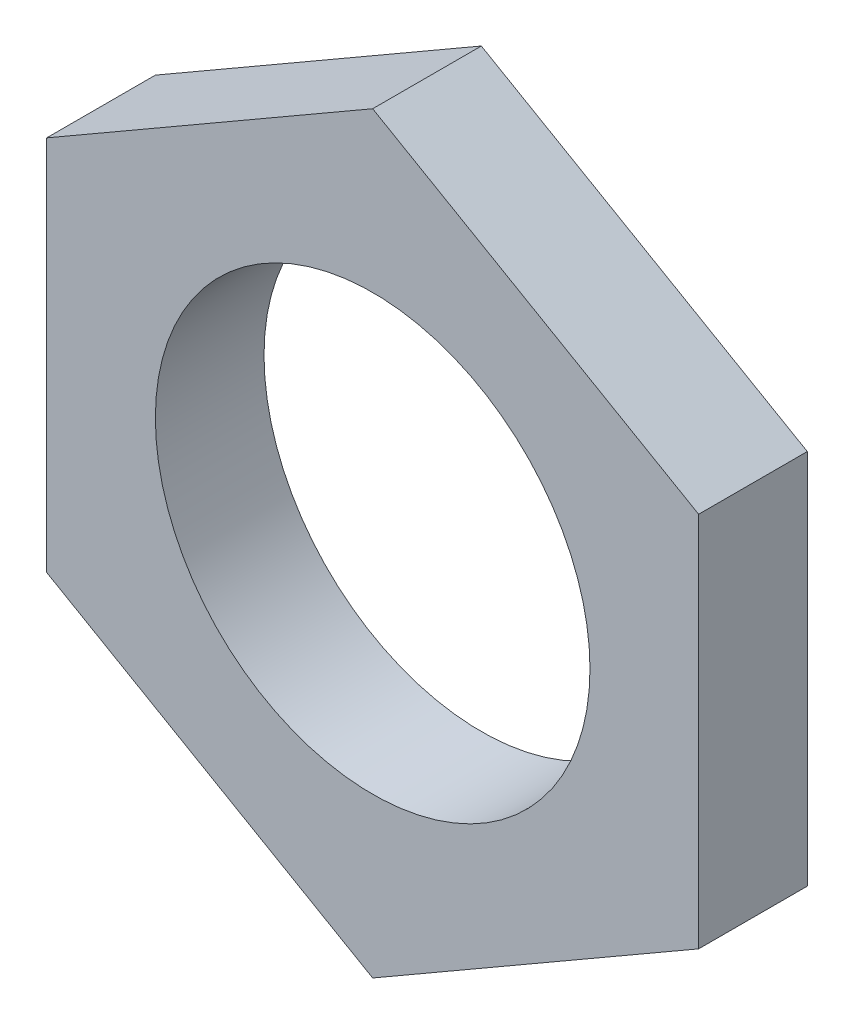
ISO-10303-21;
HEADER;
FILE_DESCRIPTION(('STEP AP214'),'2;1');
FILE_NAME('part.step','',(''),(''),'','','');
FILE_SCHEMA(('AUTOMOTIVE_DESIGN { 1 0 10303 214 1 1 1 1 }'));
ENDSEC;
DATA;
#1=APPLICATION_CONTEXT('core data for automotive mechanical design processes');
#2=APPLICATION_PROTOCOL_DEFINITION('international standard','automotive_design',2000,#1);
#3=PRODUCT_CONTEXT('',#1,'mechanical');
#4=PRODUCT('Part','Part','',(#3));
#5=PRODUCT_RELATED_PRODUCT_CATEGORY('part','',(#4));
#6=PRODUCT_DEFINITION_FORMATION('','',#4);
#7=PRODUCT_DEFINITION_CONTEXT('part definition',#1,'design');
#8=PRODUCT_DEFINITION('design','',#6,#7);
#9=PRODUCT_DEFINITION_SHAPE('','',#8);
#10=(LENGTH_UNIT() NAMED_UNIT(*) SI_UNIT(.MILLI.,.METRE.));
#11=(NAMED_UNIT(*) PLANE_ANGLE_UNIT() SI_UNIT($,.RADIAN.));
#12=(NAMED_UNIT(*) SI_UNIT($,.STERADIAN.) SOLID_ANGLE_UNIT());
#13=UNCERTAINTY_MEASURE_WITH_UNIT(LENGTH_MEASURE(1.E-05),#10,'distance_accuracy_value','');
#14=(GEOMETRIC_REPRESENTATION_CONTEXT(3) GLOBAL_UNCERTAINTY_ASSIGNED_CONTEXT((#13)) GLOBAL_UNIT_ASSIGNED_CONTEXT((#10,
#11,#12)) REPRESENTATION_CONTEXT('',''));
#15=CARTESIAN_POINT('',(0.,0.,0.));
#16=DIRECTION('',(0.,0.,1.));
#17=DIRECTION('',(1.,0.,0.));
#18=AXIS2_PLACEMENT_3D('',#15,#16,#17);
#19=CARTESIAN_POINT('',(0.,0.,2.));
#20=DIRECTION('',(0.,0.,1.));
#21=DIRECTION('',(1.,0.,0.));
#22=AXIS2_PLACEMENT_3D('',#19,#20,#21);
#23=PLANE('',#22);
#24=DIRECTION('',(-0.866025403784439,0.5,0.));
#25=VECTOR('',#24,1.);
#26=CARTESIAN_POINT('',(6.,3.46410161513776,2.));
#27=LINE('',#26,#25);
#28=CARTESIAN_POINT('',(6.,3.46410161513776,2.));
#29=VERTEX_POINT('',#28);
#30=CARTESIAN_POINT('',(0.,6.92820323027551,2.));
#31=VERTEX_POINT('',#30);
#32=EDGE_CURVE('E133',#29,#31,#27,.T.);
#33=ORIENTED_EDGE('',*,*,#32,.T.);
#34=DIRECTION('',(-0.866025403784439,-0.5,0.));
#35=VECTOR('',#34,1.);
#36=CARTESIAN_POINT('',(0.,6.92820323027551,2.));
#37=LINE('',#36,#35);
#38=CARTESIAN_POINT('',(-6.,3.46410161513776,2.));
#39=VERTEX_POINT('',#38);
#40=EDGE_CURVE('E91',#31,#39,#37,.T.);
#41=ORIENTED_EDGE('',*,*,#40,.T.);
#42=DIRECTION('',(0.,-1.,0.));
#43=VECTOR('',#42,1.);
#44=CARTESIAN_POINT('',(-6.,3.46410161513776,2.));
#45=LINE('',#44,#43);
#46=CARTESIAN_POINT('',(-6.,-3.46410161513775,2.));
#47=VERTEX_POINT('',#46);
#48=EDGE_CURVE('E104',#39,#47,#45,.T.);
#49=ORIENTED_EDGE('',*,*,#48,.T.);
#50=DIRECTION('',(0.866025403784439,-0.5,0.));
#51=VECTOR('',#50,1.);
#52=CARTESIAN_POINT('',(-6.,-3.46410161513775,2.));
#53=LINE('',#52,#51);
#54=CARTESIAN_POINT('',(0.,-6.92820323027551,2.));
#55=VERTEX_POINT('',#54);
#56=EDGE_CURVE('E98',#47,#55,#53,.T.);
#57=ORIENTED_EDGE('',*,*,#56,.T.);
#58=DIRECTION('',(0.866025403784439,0.5,0.));
#59=VECTOR('',#58,1.);
#60=CARTESIAN_POINT('',(0.,-6.92820323027551,2.));
#61=LINE('',#60,#59);
#62=CARTESIAN_POINT('',(6.,-3.46410161513776,2.));
#63=VERTEX_POINT('',#62);
#64=EDGE_CURVE('E102',#55,#63,#61,.T.);
#65=ORIENTED_EDGE('',*,*,#64,.T.);
#66=DIRECTION('',(0.,1.,0.));
#67=VECTOR('',#66,1.);
#68=CARTESIAN_POINT('',(6.,-3.46410161513776,2.));
#69=LINE('',#68,#67);
#70=EDGE_CURVE('E54',#63,#29,#69,.T.);
#71=ORIENTED_EDGE('',*,*,#70,.T.);
#72=EDGE_LOOP('',(#33,#41,#49,#57,#65,#71));
#73=FACE_BOUND('',#72,.T.);
#74=CARTESIAN_POINT('',(0.,0.,2.));
#75=DIRECTION('',(0.,0.,1.));
#76=DIRECTION('',(1.,0.,0.));
#77=AXIS2_PLACEMENT_3D('',#74,#75,#76);
#78=CIRCLE('',#77,4.);
#79=CARTESIAN_POINT('',(4.,0.,2.));
#80=VERTEX_POINT('',#79);
#81=EDGE_CURVE('E126',#80,#80,#78,.T.);
#82=ORIENTED_EDGE('',*,*,#81,.F.);
#83=EDGE_LOOP('',(#82));
#84=FACE_BOUND('',#83,.T.);
#85=ADVANCED_FACE('F37',(#73,#84),#23,.T.);
#86=CARTESIAN_POINT('',(0.,0.,0.));
#87=DIRECTION('',(0.,0.,1.));
#88=DIRECTION('',(1.,0.,0.));
#89=AXIS2_PLACEMENT_3D('',#86,#87,#88);
#90=PLANE('',#89);
#91=DIRECTION('',(-0.866025403784439,0.5,0.));
#92=VECTOR('',#91,1.);
#93=CARTESIAN_POINT('',(6.,3.46410161513776,0.));
#94=LINE('',#93,#92);
#95=CARTESIAN_POINT('',(6.,3.46410161513776,0.));
#96=VERTEX_POINT('',#95);
#97=CARTESIAN_POINT('',(0.,6.92820323027551,0.));
#98=VERTEX_POINT('',#97);
#99=EDGE_CURVE('E122',#96,#98,#94,.T.);
#100=ORIENTED_EDGE('',*,*,#99,.F.);
#101=DIRECTION('',(0.,1.,0.));
#102=VECTOR('',#101,1.);
#103=CARTESIAN_POINT('',(6.,-3.46410161513776,0.));
#104=LINE('',#103,#102);
#105=CARTESIAN_POINT('',(6.,-3.46410161513776,0.));
#106=VERTEX_POINT('',#105);
#107=EDGE_CURVE('E83',#106,#96,#104,.T.);
#108=ORIENTED_EDGE('',*,*,#107,.F.);
#109=DIRECTION('',(0.866025403784439,0.5,0.));
#110=VECTOR('',#109,1.);
#111=CARTESIAN_POINT('',(0.,-6.92820323027551,0.));
#112=LINE('',#111,#110);
#113=CARTESIAN_POINT('',(0.,-6.92820323027551,0.));
#114=VERTEX_POINT('',#113);
#115=EDGE_CURVE('E77',#114,#106,#112,.T.);
#116=ORIENTED_EDGE('',*,*,#115,.F.);
#117=DIRECTION('',(0.866025403784439,-0.5,0.));
#118=VECTOR('',#117,1.);
#119=CARTESIAN_POINT('',(-6.,-3.46410161513775,0.));
#120=LINE('',#119,#118);
#121=CARTESIAN_POINT('',(-6.,-3.46410161513775,0.));
#122=VERTEX_POINT('',#121);
#123=EDGE_CURVE('E112',#122,#114,#120,.T.);
#124=ORIENTED_EDGE('',*,*,#123,.F.);
#125=DIRECTION('',(0.,-1.,0.));
#126=VECTOR('',#125,1.);
#127=CARTESIAN_POINT('',(-6.,3.46410161513776,0.));
#128=LINE('',#127,#126);
#129=CARTESIAN_POINT('',(-6.,3.46410161513776,0.));
#130=VERTEX_POINT('',#129);
#131=EDGE_CURVE('E128',#130,#122,#128,.T.);
#132=ORIENTED_EDGE('',*,*,#131,.F.);
#133=DIRECTION('',(-0.866025403784439,-0.5,0.));
#134=VECTOR('',#133,1.);
#135=CARTESIAN_POINT('',(0.,6.92820323027551,0.));
#136=LINE('',#135,#134);
#137=EDGE_CURVE('E125',#98,#130,#136,.T.);
#138=ORIENTED_EDGE('',*,*,#137,.F.);
#139=EDGE_LOOP('',(#100,#108,#116,#124,#132,#138));
#140=FACE_BOUND('',#139,.T.);
#141=CARTESIAN_POINT('',(0.,0.,0.));
#142=DIRECTION('',(0.,0.,1.));
#143=DIRECTION('',(1.,0.,0.));
#144=AXIS2_PLACEMENT_3D('',#141,#142,#143);
#145=CIRCLE('',#144,4.);
#146=CARTESIAN_POINT('',(4.,0.,0.));
#147=VERTEX_POINT('',#146);
#148=EDGE_CURVE('E226',#147,#147,#145,.T.);
#149=ORIENTED_EDGE('',*,*,#148,.T.);
#150=EDGE_LOOP('',(#149));
#151=FACE_BOUND('',#150,.T.);
#152=ADVANCED_FACE('F142',(#140,#151),#90,.F.);
#153=CARTESIAN_POINT('',(6.,3.46410161513776,2.));
#154=DIRECTION('',(-0.5,-0.866025403784439,0.));
#155=DIRECTION('',(0.866025403784439,-0.5,0.));
#156=AXIS2_PLACEMENT_3D('',#153,#154,#155);
#157=PLANE('',#156);
#158=ORIENTED_EDGE('',*,*,#99,.T.);
#159=DIRECTION('',(0.,0.,-1.));
#160=VECTOR('',#159,1.);
#161=CARTESIAN_POINT('',(0.,6.92820323027551,2.));
#162=LINE('',#161,#160);
#163=EDGE_CURVE('E11',#31,#98,#162,.T.);
#164=ORIENTED_EDGE('',*,*,#163,.F.);
#165=ORIENTED_EDGE('',*,*,#32,.F.);
#166=DIRECTION('',(0.,0.,-1.));
#167=VECTOR('',#166,1.);
#168=CARTESIAN_POINT('',(6.,3.46410161513776,2.));
#169=LINE('',#168,#167);
#170=EDGE_CURVE('E118',#29,#96,#169,.T.);
#171=ORIENTED_EDGE('',*,*,#170,.T.);
#172=EDGE_LOOP('',(#158,#164,#165,#171));
#173=FACE_BOUND('',#172,.T.);
#174=ADVANCED_FACE('F39',(#173),#157,.F.);
#175=CARTESIAN_POINT('',(0.,6.92820323027551,2.));
#176=DIRECTION('',(0.5,-0.866025403784439,0.));
#177=DIRECTION('',(0.866025403784439,0.5,0.));
#178=AXIS2_PLACEMENT_3D('',#175,#176,#177);
#179=PLANE('',#178);
#180=ORIENTED_EDGE('',*,*,#137,.T.);
#181=DIRECTION('',(0.,0.,-1.));
#182=VECTOR('',#181,1.);
#183=CARTESIAN_POINT('',(-6.,3.46410161513776,2.));
#184=LINE('',#183,#182);
#185=EDGE_CURVE('E46',#39,#130,#184,.T.);
#186=ORIENTED_EDGE('',*,*,#185,.F.);
#187=ORIENTED_EDGE('',*,*,#40,.F.);
#188=ORIENTED_EDGE('',*,*,#163,.T.);
#189=EDGE_LOOP('',(#180,#186,#187,#188));
#190=FACE_BOUND('',#189,.T.);
#191=ADVANCED_FACE('F167',(#190),#179,.F.);
#192=CARTESIAN_POINT('',(-6.,3.46410161513776,2.));
#193=DIRECTION('',(1.,0.,0.));
#194=DIRECTION('',(0.,1.,0.));
#195=AXIS2_PLACEMENT_3D('',#192,#193,#194);
#196=PLANE('',#195);
#197=ORIENTED_EDGE('',*,*,#131,.T.);
#198=DIRECTION('',(0.,0.,-1.));
#199=VECTOR('',#198,1.);
#200=CARTESIAN_POINT('',(-6.,-3.46410161513775,2.));
#201=LINE('',#200,#199);
#202=EDGE_CURVE('E113',#47,#122,#201,.T.);
#203=ORIENTED_EDGE('',*,*,#202,.F.);
#204=ORIENTED_EDGE('',*,*,#48,.F.);
#205=ORIENTED_EDGE('',*,*,#185,.T.);
#206=EDGE_LOOP('',(#197,#203,#204,#205));
#207=FACE_BOUND('',#206,.T.);
#208=ADVANCED_FACE('F139',(#207),#196,.F.);
#209=CARTESIAN_POINT('',(-6.,-3.46410161513775,2.));
#210=DIRECTION('',(0.5,0.866025403784439,0.));
#211=DIRECTION('',(-0.866025403784439,0.5,0.));
#212=AXIS2_PLACEMENT_3D('',#209,#210,#211);
#213=PLANE('',#212);
#214=ORIENTED_EDGE('',*,*,#123,.T.);
#215=DIRECTION('',(0.,0.,-1.));
#216=VECTOR('',#215,1.);
#217=CARTESIAN_POINT('',(0.,-6.92820323027551,2.));
#218=LINE('',#217,#216);
#219=EDGE_CURVE('E109',#55,#114,#218,.T.);
#220=ORIENTED_EDGE('',*,*,#219,.F.);
#221=ORIENTED_EDGE('',*,*,#56,.F.);
#222=ORIENTED_EDGE('',*,*,#202,.T.);
#223=EDGE_LOOP('',(#214,#220,#221,#222));
#224=FACE_BOUND('',#223,.T.);
#225=ADVANCED_FACE('F110',(#224),#213,.F.);
#226=CARTESIAN_POINT('',(0.,-6.92820323027551,2.));
#227=DIRECTION('',(-0.5,0.866025403784439,0.));
#228=DIRECTION('',(-0.866025403784439,-0.5,0.));
#229=AXIS2_PLACEMENT_3D('',#226,#227,#228);
#230=PLANE('',#229);
#231=ORIENTED_EDGE('',*,*,#115,.T.);
#232=DIRECTION('',(0.,0.,-1.));
#233=VECTOR('',#232,1.);
#234=CARTESIAN_POINT('',(6.,-3.46410161513776,2.));
#235=LINE('',#234,#233);
#236=EDGE_CURVE('E114',#63,#106,#235,.T.);
#237=ORIENTED_EDGE('',*,*,#236,.F.);
#238=ORIENTED_EDGE('',*,*,#64,.F.);
#239=ORIENTED_EDGE('',*,*,#219,.T.);
#240=EDGE_LOOP('',(#231,#237,#238,#239));
#241=FACE_BOUND('',#240,.T.);
#242=ADVANCED_FACE('F116',(#241),#230,.F.);
#243=CARTESIAN_POINT('',(6.,-3.46410161513776,2.));
#244=DIRECTION('',(-1.,0.,0.));
#245=DIRECTION('',(0.,0.,1.));
#246=AXIS2_PLACEMENT_3D('',#243,#244,#245);
#247=PLANE('',#246);
#248=ORIENTED_EDGE('',*,*,#107,.T.);
#249=ORIENTED_EDGE('',*,*,#170,.F.);
#250=ORIENTED_EDGE('',*,*,#70,.F.);
#251=ORIENTED_EDGE('',*,*,#236,.T.);
#252=EDGE_LOOP('',(#248,#249,#250,#251));
#253=FACE_BOUND('',#252,.T.);
#254=ADVANCED_FACE('F147',(#253),#247,.F.);
#255=CARTESIAN_POINT('',(0.,0.,2.));
#256=DIRECTION('',(0.,0.,-1.));
#257=DIRECTION('',(-1.,0.,0.));
#258=AXIS2_PLACEMENT_3D('',#255,#256,#257);
#259=CYLINDRICAL_SURFACE('',#258,4.);
#260=ORIENTED_EDGE('',*,*,#81,.T.);
#261=EDGE_LOOP('',(#260));
#262=FACE_BOUND('',#261,.T.);
#263=ORIENTED_EDGE('',*,*,#148,.F.);
#264=EDGE_LOOP('',(#263));
#265=FACE_BOUND('',#264,.T.);
#266=ADVANCED_FACE('F149',(#262,#265),#259,.F.);
#267=CLOSED_SHELL('',(#85,#152,#174,#191,#208,#225,#242,#254,#266));
#268=MANIFOLD_SOLID_BREP('B2',#267);
#269=ADVANCED_BREP_SHAPE_REPRESENTATION('',(#18,#268),#14);
#270=SHAPE_DEFINITION_REPRESENTATION(#9,#269);
ENDSEC;
END-ISO-10303-21;
